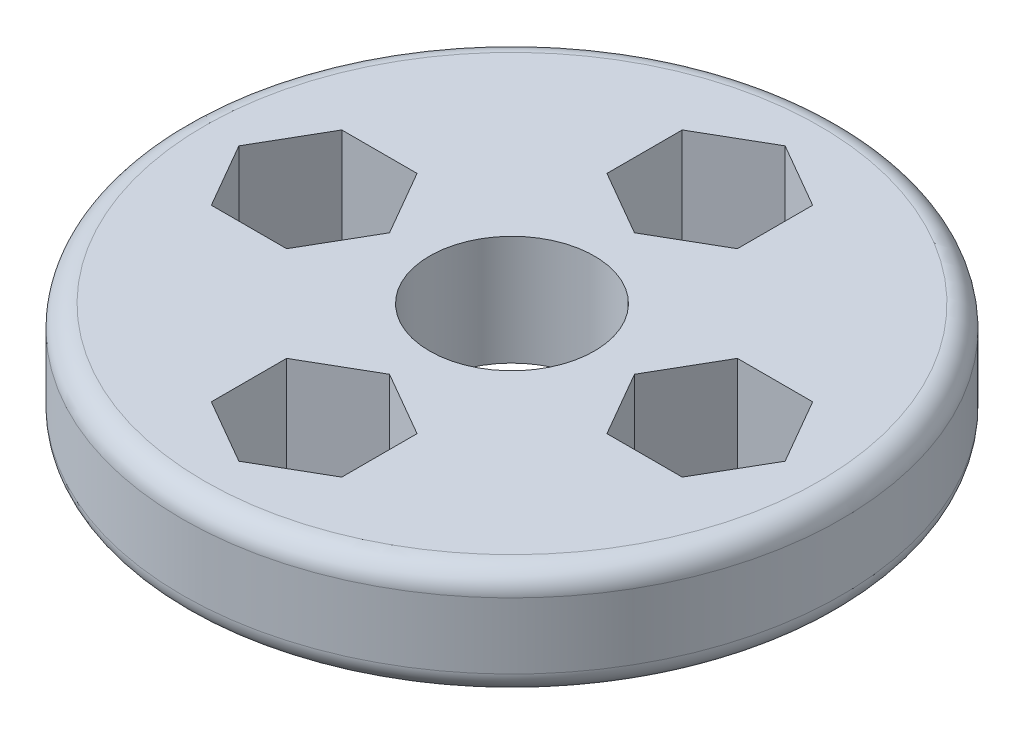
ISO-10303-21;
HEADER;
FILE_DESCRIPTION(('STEP AP214'),'2;1');
FILE_NAME('part.step','',(''),(''),'','','');
FILE_SCHEMA(('AUTOMOTIVE_DESIGN { 1 0 10303 214 1 1 1 1 }'));
ENDSEC;
DATA;
#1=APPLICATION_CONTEXT('core data for automotive mechanical design processes');
#2=APPLICATION_PROTOCOL_DEFINITION('international standard','automotive_design',2000,#1);
#3=PRODUCT_CONTEXT('',#1,'mechanical');
#4=PRODUCT('Part','Part','',(#3));
#5=PRODUCT_RELATED_PRODUCT_CATEGORY('part','',(#4));
#6=PRODUCT_DEFINITION_FORMATION('','',#4);
#7=PRODUCT_DEFINITION_CONTEXT('part definition',#1,'design');
#8=PRODUCT_DEFINITION('design','',#6,#7);
#9=PRODUCT_DEFINITION_SHAPE('','',#8);
#10=(LENGTH_UNIT() NAMED_UNIT(*) SI_UNIT(.MILLI.,.METRE.));
#11=(NAMED_UNIT(*) PLANE_ANGLE_UNIT() SI_UNIT($,.RADIAN.));
#12=(NAMED_UNIT(*) SI_UNIT($,.STERADIAN.) SOLID_ANGLE_UNIT());
#13=UNCERTAINTY_MEASURE_WITH_UNIT(LENGTH_MEASURE(1.E-05),#10,'distance_accuracy_value','');
#14=(GEOMETRIC_REPRESENTATION_CONTEXT(3) GLOBAL_UNCERTAINTY_ASSIGNED_CONTEXT((#13)) GLOBAL_UNIT_ASSIGNED_CONTEXT((#10,
#11,#12)) REPRESENTATION_CONTEXT('',''));
#15=CARTESIAN_POINT('',(0.,0.,0.));
#16=DIRECTION('',(0.,0.,1.));
#17=DIRECTION('',(1.,0.,0.));
#18=AXIS2_PLACEMENT_3D('',#15,#16,#17);
#19=CARTESIAN_POINT('',(0.,10.,0.));
#20=DIRECTION('',(0.,-1.,0.));
#21=DIRECTION('',(0.,0.,-1.));
#22=AXIS2_PLACEMENT_3D('',#19,#20,#21);
#23=CYLINDRICAL_SURFACE('',#22,30.);
#24=CARTESIAN_POINT('',(0.,2.,0.));
#25=DIRECTION('',(0.,1.,0.));
#26=DIRECTION('',(0.,0.,1.));
#27=AXIS2_PLACEMENT_3D('',#24,#25,#26);
#28=CIRCLE('',#27,30.);
#29=CARTESIAN_POINT('',(0.,2.,30.));
#30=VERTEX_POINT('',#29);
#31=EDGE_CURVE('E402',#30,#30,#28,.T.);
#32=ORIENTED_EDGE('',*,*,#31,.T.);
#33=EDGE_LOOP('',(#32));
#34=FACE_BOUND('',#33,.T.);
#35=CARTESIAN_POINT('',(0.,8.,0.));
#36=DIRECTION('',(0.,1.,0.));
#37=DIRECTION('',(0.,0.,1.));
#38=AXIS2_PLACEMENT_3D('',#35,#36,#37);
#39=CIRCLE('',#38,30.);
#40=CARTESIAN_POINT('',(0.,8.,30.));
#41=VERTEX_POINT('',#40);
#42=EDGE_CURVE('E397',#41,#41,#39,.F.);
#43=ORIENTED_EDGE('',*,*,#42,.T.);
#44=EDGE_LOOP('',(#43));
#45=FACE_BOUND('',#44,.T.);
#46=ADVANCED_FACE('F35',(#34,#45),#23,.T.);
#47=CARTESIAN_POINT('',(0.,10.,0.));
#48=DIRECTION('',(0.,1.,0.));
#49=DIRECTION('',(0.,0.,1.));
#50=AXIS2_PLACEMENT_3D('',#47,#48,#49);
#51=PLANE('',#50);
#52=DIRECTION('',(0.499999999999992,0.,-0.866025403784443));
#53=VECTOR('',#52,1.);
#54=CARTESIAN_POINT('',(-14.5786360829087,10.,5.93647889551821));
#55=LINE('',#54,#53);
#56=CARTESIAN_POINT('',(-14.5786360829087,10.,5.93647889551821));
#57=VERTEX_POINT('',#56);
#58=CARTESIAN_POINT('',(-11.1512083945428,10.,0.));
#59=VERTEX_POINT('',#58);
#60=EDGE_CURVE('E50',#57,#59,#55,.T.);
#61=ORIENTED_EDGE('',*,*,#60,.F.);
#62=DIRECTION('',(1.,0.,0.));
#63=VECTOR('',#62,1.);
#64=CARTESIAN_POINT('',(-21.4334914596406,10.,5.93647889551831));
#65=LINE('',#64,#63);
#66=CARTESIAN_POINT('',(-21.4334914596406,10.,5.93647889551831));
#67=VERTEX_POINT('',#66);
#68=EDGE_CURVE('E218',#67,#57,#65,.T.);
#69=ORIENTED_EDGE('',*,*,#68,.F.);
#70=DIRECTION('',(0.50000000000001,0.,0.866025403784433));
#71=VECTOR('',#70,1.);
#72=CARTESIAN_POINT('',(-24.8609191480067,10.,1.34668634528409E-13));
#73=LINE('',#72,#71);
#74=CARTESIAN_POINT('',(-24.8609191480067,10.,1.34668634528409E-13));
#75=VERTEX_POINT('',#74);
#76=EDGE_CURVE('E221',#75,#67,#73,.T.);
#77=ORIENTED_EDGE('',*,*,#76,.F.);
#78=DIRECTION('',(-0.499999999999992,0.,0.866025403784443));
#79=VECTOR('',#78,1.);
#80=CARTESIAN_POINT('',(-21.4334914596408,10.,-5.93647889551811));
#81=LINE('',#80,#79);
#82=CARTESIAN_POINT('',(-21.4334914596408,10.,-5.93647889551811));
#83=VERTEX_POINT('',#82);
#84=EDGE_CURVE('E238',#83,#75,#81,.T.);
#85=ORIENTED_EDGE('',*,*,#84,.F.);
#86=DIRECTION('',(-1.,0.,0.));
#87=VECTOR('',#86,1.);
#88=CARTESIAN_POINT('',(-14.5786360829088,10.,-5.93647889551816));
#89=LINE('',#88,#87);
#90=CARTESIAN_POINT('',(-14.5786360829088,10.,-5.93647889551816));
#91=VERTEX_POINT('',#90);
#92=EDGE_CURVE('E235',#91,#83,#89,.T.);
#93=ORIENTED_EDGE('',*,*,#92,.F.);
#94=DIRECTION('',(-0.500000000000004,0.,-0.866025403784436));
#95=VECTOR('',#94,1.);
#96=CARTESIAN_POINT('',(-11.1512083945428,10.,0.));
#97=LINE('',#96,#95);
#98=EDGE_CURVE('E232',#59,#91,#97,.T.);
#99=ORIENTED_EDGE('',*,*,#98,.F.);
#100=EDGE_LOOP('',(#61,#69,#77,#85,#93,#99));
#101=FACE_BOUND('',#100,.T.);
#102=DIRECTION('',(-0.866025403784442,0.,-0.499999999999995));
#103=VECTOR('',#102,1.);
#104=CARTESIAN_POINT('',(5.93647889551816,10.,14.5786360829087));
#105=LINE('',#104,#103);
#106=CARTESIAN_POINT('',(5.93647889551816,10.,14.5786360829087));
#107=VERTEX_POINT('',#106);
#108=CARTESIAN_POINT('',(0.,10.,11.1512083945428));
#109=VERTEX_POINT('',#108);
#110=EDGE_CURVE('E58',#107,#109,#105,.T.);
#111=ORIENTED_EDGE('',*,*,#110,.F.);
#112=DIRECTION('',(0.,0.,-1.));
#113=VECTOR('',#112,1.);
#114=CARTESIAN_POINT('',(5.93647889551823,10.,21.4334914596407));
#115=LINE('',#114,#113);
#116=CARTESIAN_POINT('',(5.93647889551823,10.,21.4334914596407));
#117=VERTEX_POINT('',#116);
#118=EDGE_CURVE('E257',#117,#107,#115,.T.);
#119=ORIENTED_EDGE('',*,*,#118,.F.);
#120=DIRECTION('',(0.866025403784435,0.,-0.500000000000007));
#121=VECTOR('',#120,1.);
#122=CARTESIAN_POINT('',(0.,10.,24.8609191480067));
#123=LINE('',#122,#121);
#124=CARTESIAN_POINT('',(0.,10.,24.8609191480067));
#125=VERTEX_POINT('',#124);
#126=EDGE_CURVE('E284',#125,#117,#123,.T.);
#127=ORIENTED_EDGE('',*,*,#126,.F.);
#128=DIRECTION('',(0.866025403784441,0.,0.499999999999995));
#129=VECTOR('',#128,1.);
#130=CARTESIAN_POINT('',(-5.93647889551818,10.,21.4334914596407));
#131=LINE('',#130,#129);
#132=CARTESIAN_POINT('',(-5.93647889551818,10.,21.4334914596407));
#133=VERTEX_POINT('',#132);
#134=EDGE_CURVE('E281',#133,#125,#131,.T.);
#135=ORIENTED_EDGE('',*,*,#134,.F.);
#136=DIRECTION('',(0.,0.,1.));
#137=VECTOR('',#136,1.);
#138=CARTESIAN_POINT('',(-5.93647889551821,10.,14.5786360829088));
#139=LINE('',#138,#137);
#140=CARTESIAN_POINT('',(-5.93647889551821,10.,14.5786360829088));
#141=VERTEX_POINT('',#140);
#142=EDGE_CURVE('E278',#141,#133,#139,.T.);
#143=ORIENTED_EDGE('',*,*,#142,.F.);
#144=DIRECTION('',(-0.866025403784438,0.,0.500000000000001));
#145=VECTOR('',#144,1.);
#146=CARTESIAN_POINT('',(0.,10.,11.1512083945428));
#147=LINE('',#146,#145);
#148=EDGE_CURVE('E274',#109,#141,#147,.T.);
#149=ORIENTED_EDGE('',*,*,#148,.F.);
#150=EDGE_LOOP('',(#111,#119,#127,#135,#143,#149));
#151=FACE_BOUND('',#150,.T.);
#152=DIRECTION('',(-0.499999999999986,0.,0.866025403784447));
#153=VECTOR('',#152,1.);
#154=CARTESIAN_POINT('',(14.5786360829087,10.,-5.93647889551831));
#155=LINE('',#154,#153);
#156=CARTESIAN_POINT('',(14.5786360829087,10.,-5.93647889551831));
#157=VERTEX_POINT('',#156);
#158=CARTESIAN_POINT('',(11.1512083945428,10.,-1.16226472890446E-13));
#159=VERTEX_POINT('',#158);
#160=EDGE_CURVE('E319',#157,#159,#155,.T.);
#161=ORIENTED_EDGE('',*,*,#160,.F.);
#162=DIRECTION('',(-1.,0.,0.));
#163=VECTOR('',#162,1.);
#164=CARTESIAN_POINT('',(21.4334914596406,10.,-5.93647889551846));
#165=LINE('',#164,#163);
#166=CARTESIAN_POINT('',(21.4334914596406,10.,-5.93647889551846));
#167=VERTEX_POINT('',#166);
#168=EDGE_CURVE('E303',#167,#157,#165,.T.);
#169=ORIENTED_EDGE('',*,*,#168,.F.);
#170=DIRECTION('',(-0.500000000000016,0.,-0.866025403784429));
#171=VECTOR('',#170,1.);
#172=CARTESIAN_POINT('',(24.8609191480067,10.,-3.08271505071916E-13));
#173=LINE('',#172,#171);
#174=CARTESIAN_POINT('',(24.8609191480067,10.,-3.08271505071916E-13));
#175=VERTEX_POINT('',#174);
#176=EDGE_CURVE('E330',#175,#167,#173,.T.);
#177=ORIENTED_EDGE('',*,*,#176,.F.);
#178=DIRECTION('',(0.499999999999986,0.,-0.866025403784447));
#179=VECTOR('',#178,1.);
#180=CARTESIAN_POINT('',(21.4334914596408,10.,5.93647889551796));
#181=LINE('',#180,#179);
#182=CARTESIAN_POINT('',(21.4334914596408,10.,5.93647889551796));
#183=VERTEX_POINT('',#182);
#184=EDGE_CURVE('E327',#183,#175,#181,.T.);
#185=ORIENTED_EDGE('',*,*,#184,.F.);
#186=DIRECTION('',(1.,0.,0.));
#187=VECTOR('',#186,1.);
#188=CARTESIAN_POINT('',(14.5786360829089,10.,5.93647889551806));
#189=LINE('',#188,#187);
#190=CARTESIAN_POINT('',(14.5786360829089,10.,5.93647889551806));
#191=VERTEX_POINT('',#190);
#192=EDGE_CURVE('E324',#191,#183,#189,.T.);
#193=ORIENTED_EDGE('',*,*,#192,.F.);
#194=DIRECTION('',(0.50000000000001,0.,0.866025403784433));
#195=VECTOR('',#194,1.);
#196=CARTESIAN_POINT('',(11.1512083945428,10.,-1.16802708045291E-13));
#197=LINE('',#196,#195);
#198=EDGE_CURVE('E321',#159,#191,#197,.T.);
#199=ORIENTED_EDGE('',*,*,#198,.F.);
#200=EDGE_LOOP('',(#161,#169,#177,#185,#193,#199));
#201=FACE_BOUND('',#200,.T.);
#202=DIRECTION('',(0.866025403784442,0.,0.499999999999995));
#203=VECTOR('',#202,1.);
#204=CARTESIAN_POINT('',(-5.93647889551816,10.,-14.5786360829087));
#205=LINE('',#204,#203);
#206=CARTESIAN_POINT('',(-5.93647889551816,10.,-14.5786360829087));
#207=VERTEX_POINT('',#206);
#208=CARTESIAN_POINT('',(0.,10.,-11.1512083945428));
#209=VERTEX_POINT('',#208);
#210=EDGE_CURVE('E245',#207,#209,#205,.T.);
#211=ORIENTED_EDGE('',*,*,#210,.F.);
#212=DIRECTION('',(0.,0.,1.));
#213=VECTOR('',#212,1.);
#214=CARTESIAN_POINT('',(-5.93647889551823,10.,-21.4334914596407));
#215=LINE('',#214,#213);
#216=CARTESIAN_POINT('',(-5.93647889551823,10.,-21.4334914596407));
#217=VERTEX_POINT('',#216);
#218=EDGE_CURVE('E350',#217,#207,#215,.T.);
#219=ORIENTED_EDGE('',*,*,#218,.F.);
#220=DIRECTION('',(-0.866025403784435,0.,0.500000000000007));
#221=VECTOR('',#220,1.);
#222=CARTESIAN_POINT('',(0.,10.,-24.8609191480067));
#223=LINE('',#222,#221);
#224=CARTESIAN_POINT('',(0.,10.,-24.8609191480067));
#225=VERTEX_POINT('',#224);
#226=EDGE_CURVE('E376',#225,#217,#223,.T.);
#227=ORIENTED_EDGE('',*,*,#226,.F.);
#228=DIRECTION('',(-0.866025403784441,0.,-0.499999999999995));
#229=VECTOR('',#228,1.);
#230=CARTESIAN_POINT('',(5.93647889551818,10.,-21.4334914596407));
#231=LINE('',#230,#229);
#232=CARTESIAN_POINT('',(5.93647889551818,10.,-21.4334914596407));
#233=VERTEX_POINT('',#232);
#234=EDGE_CURVE('E373',#233,#225,#231,.T.);
#235=ORIENTED_EDGE('',*,*,#234,.F.);
#236=DIRECTION('',(0.,0.,-1.));
#237=VECTOR('',#236,1.);
#238=CARTESIAN_POINT('',(5.93647889551821,10.,-14.5786360829088));
#239=LINE('',#238,#237);
#240=CARTESIAN_POINT('',(5.93647889551821,10.,-14.5786360829088));
#241=VERTEX_POINT('',#240);
#242=EDGE_CURVE('E370',#241,#233,#239,.T.);
#243=ORIENTED_EDGE('',*,*,#242,.F.);
#244=DIRECTION('',(0.866025403784438,0.,-0.500000000000001));
#245=VECTOR('',#244,1.);
#246=CARTESIAN_POINT('',(0.,10.,-11.1512083945428));
#247=LINE('',#246,#245);
#248=EDGE_CURVE('E367',#209,#241,#247,.T.);
#249=ORIENTED_EDGE('',*,*,#248,.F.);
#250=EDGE_LOOP('',(#211,#219,#227,#235,#243,#249));
#251=FACE_BOUND('',#250,.T.);
#252=CARTESIAN_POINT('',(0.,10.,0.));
#253=DIRECTION('',(0.,1.,0.));
#254=DIRECTION('',(0.,0.,1.));
#255=AXIS2_PLACEMENT_3D('',#252,#253,#254);
#256=CIRCLE('',#255,28.);
#257=CARTESIAN_POINT('',(0.,10.,28.));
#258=VERTEX_POINT('',#257);
#259=EDGE_CURVE('E11',#258,#258,#256,.T.);
#260=ORIENTED_EDGE('',*,*,#259,.T.);
#261=EDGE_LOOP('',(#260));
#262=FACE_BOUND('',#261,.T.);
#263=CARTESIAN_POINT('',(0.,10.,0.));
#264=DIRECTION('',(0.,1.,0.));
#265=DIRECTION('',(0.,0.,1.));
#266=AXIS2_PLACEMENT_3D('',#263,#264,#265);
#267=CIRCLE('',#266,7.5);
#268=CARTESIAN_POINT('',(0.,10.,7.5));
#269=VERTEX_POINT('',#268);
#270=EDGE_CURVE('E383',#269,#269,#267,.T.);
#271=ORIENTED_EDGE('',*,*,#270,.F.);
#272=EDGE_LOOP('',(#271));
#273=FACE_BOUND('',#272,.T.);
#274=ADVANCED_FACE('F417',(#101,#151,#201,#251,#262,#273),#51,.T.);
#275=CARTESIAN_POINT('',(0.,0.,0.));
#276=DIRECTION('',(0.,1.,0.));
#277=DIRECTION('',(0.,0.,1.));
#278=AXIS2_PLACEMENT_3D('',#275,#276,#277);
#279=PLANE('',#278);
#280=DIRECTION('',(1.,0.,0.));
#281=VECTOR('',#280,1.);
#282=CARTESIAN_POINT('',(-21.4334914596406,0.,5.93647889551831));
#283=LINE('',#282,#281);
#284=CARTESIAN_POINT('',(-21.4334914596406,0.,5.93647889551831));
#285=VERTEX_POINT('',#284);
#286=CARTESIAN_POINT('',(-14.5786360829087,0.,5.93647889551821));
#287=VERTEX_POINT('',#286);
#288=EDGE_CURVE('E204',#285,#287,#283,.T.);
#289=ORIENTED_EDGE('',*,*,#288,.T.);
#290=DIRECTION('',(0.499999999999992,0.,-0.866025403784443));
#291=VECTOR('',#290,1.);
#292=CARTESIAN_POINT('',(-14.5786360829087,0.,5.93647889551821));
#293=LINE('',#292,#291);
#294=CARTESIAN_POINT('',(-11.1512083945428,0.,0.));
#295=VERTEX_POINT('',#294);
#296=EDGE_CURVE('E198',#287,#295,#293,.T.);
#297=ORIENTED_EDGE('',*,*,#296,.T.);
#298=DIRECTION('',(-0.500000000000004,0.,-0.866025403784436));
#299=VECTOR('',#298,1.);
#300=CARTESIAN_POINT('',(-11.1512083945428,0.,0.));
#301=LINE('',#300,#299);
#302=CARTESIAN_POINT('',(-14.5786360829088,0.,-5.93647889551816));
#303=VERTEX_POINT('',#302);
#304=EDGE_CURVE('E208',#295,#303,#301,.T.);
#305=ORIENTED_EDGE('',*,*,#304,.T.);
#306=DIRECTION('',(-1.,0.,0.));
#307=VECTOR('',#306,1.);
#308=CARTESIAN_POINT('',(-14.5786360829088,0.,-5.93647889551816));
#309=LINE('',#308,#307);
#310=CARTESIAN_POINT('',(-21.4334914596408,0.,-5.93647889551811));
#311=VERTEX_POINT('',#310);
#312=EDGE_CURVE('E212',#303,#311,#309,.T.);
#313=ORIENTED_EDGE('',*,*,#312,.T.);
#314=DIRECTION('',(-0.499999999999992,0.,0.866025403784443));
#315=VECTOR('',#314,1.);
#316=CARTESIAN_POINT('',(-21.4334914596408,0.,-5.93647889551811));
#317=LINE('',#316,#315);
#318=CARTESIAN_POINT('',(-24.8609191480067,0.,1.34668634528409E-13));
#319=VERTEX_POINT('',#318);
#320=EDGE_CURVE('E225',#311,#319,#317,.T.);
#321=ORIENTED_EDGE('',*,*,#320,.T.);
#322=DIRECTION('',(0.50000000000001,0.,0.866025403784433));
#323=VECTOR('',#322,1.);
#324=CARTESIAN_POINT('',(-24.8609191480067,0.,1.34668634528409E-13));
#325=LINE('',#324,#323);
#326=EDGE_CURVE('E228',#319,#285,#325,.T.);
#327=ORIENTED_EDGE('',*,*,#326,.T.);
#328=EDGE_LOOP('',(#289,#297,#305,#313,#321,#327));
#329=FACE_BOUND('',#328,.T.);
#330=DIRECTION('',(0.,0.,-1.));
#331=VECTOR('',#330,1.);
#332=CARTESIAN_POINT('',(5.93647889551823,0.,21.4334914596407));
#333=LINE('',#332,#331);
#334=CARTESIAN_POINT('',(5.93647889551823,0.,21.4334914596407));
#335=VERTEX_POINT('',#334);
#336=CARTESIAN_POINT('',(5.93647889551816,0.,14.5786360829087));
#337=VERTEX_POINT('',#336);
#338=EDGE_CURVE('E269',#335,#337,#333,.T.);
#339=ORIENTED_EDGE('',*,*,#338,.T.);
#340=DIRECTION('',(-0.866025403784442,0.,-0.499999999999995));
#341=VECTOR('',#340,1.);
#342=CARTESIAN_POINT('',(5.93647889551816,0.,14.5786360829087));
#343=LINE('',#342,#341);
#344=CARTESIAN_POINT('',(0.,0.,11.1512083945428));
#345=VERTEX_POINT('',#344);
#346=EDGE_CURVE('E253',#337,#345,#343,.T.);
#347=ORIENTED_EDGE('',*,*,#346,.T.);
#348=DIRECTION('',(-0.866025403784438,0.,0.500000000000001));
#349=VECTOR('',#348,1.);
#350=CARTESIAN_POINT('',(0.,0.,11.1512083945428));
#351=LINE('',#350,#349);
#352=CARTESIAN_POINT('',(-5.93647889551821,0.,14.5786360829088));
#353=VERTEX_POINT('',#352);
#354=EDGE_CURVE('E256',#345,#353,#351,.T.);
#355=ORIENTED_EDGE('',*,*,#354,.T.);
#356=DIRECTION('',(0.,0.,1.));
#357=VECTOR('',#356,1.);
#358=CARTESIAN_POINT('',(-5.93647889551821,0.,14.5786360829088));
#359=LINE('',#358,#357);
#360=CARTESIAN_POINT('',(-5.93647889551818,0.,21.4334914596407));
#361=VERTEX_POINT('',#360);
#362=EDGE_CURVE('E260',#353,#361,#359,.T.);
#363=ORIENTED_EDGE('',*,*,#362,.T.);
#364=DIRECTION('',(0.866025403784441,0.,0.499999999999995));
#365=VECTOR('',#364,1.);
#366=CARTESIAN_POINT('',(-5.93647889551818,0.,21.4334914596407));
#367=LINE('',#366,#365);
#368=CARTESIAN_POINT('',(0.,0.,24.8609191480067));
#369=VERTEX_POINT('',#368);
#370=EDGE_CURVE('E263',#361,#369,#367,.T.);
#371=ORIENTED_EDGE('',*,*,#370,.T.);
#372=DIRECTION('',(0.866025403784435,0.,-0.500000000000007));
#373=VECTOR('',#372,1.);
#374=CARTESIAN_POINT('',(0.,0.,24.8609191480067));
#375=LINE('',#374,#373);
#376=EDGE_CURVE('E266',#369,#335,#375,.T.);
#377=ORIENTED_EDGE('',*,*,#376,.T.);
#378=EDGE_LOOP('',(#339,#347,#355,#363,#371,#377));
#379=FACE_BOUND('',#378,.T.);
#380=DIRECTION('',(-1.,0.,0.));
#381=VECTOR('',#380,1.);
#382=CARTESIAN_POINT('',(21.4334914596406,0.,-5.93647889551846));
#383=LINE('',#382,#381);
#384=CARTESIAN_POINT('',(21.4334914596406,0.,-5.93647889551846));
#385=VERTEX_POINT('',#384);
#386=CARTESIAN_POINT('',(14.5786360829087,0.,-5.93647889551831));
#387=VERTEX_POINT('',#386);
#388=EDGE_CURVE('E315',#385,#387,#383,.T.);
#389=ORIENTED_EDGE('',*,*,#388,.T.);
#390=DIRECTION('',(-0.499999999999986,0.,0.866025403784447));
#391=VECTOR('',#390,1.);
#392=CARTESIAN_POINT('',(14.5786360829087,0.,-5.93647889551831));
#393=LINE('',#392,#391);
#394=CARTESIAN_POINT('',(11.1512083945428,0.,-1.16802708045291E-13));
#395=VERTEX_POINT('',#394);
#396=EDGE_CURVE('E299',#387,#395,#393,.T.);
#397=ORIENTED_EDGE('',*,*,#396,.T.);
#398=DIRECTION('',(0.50000000000001,0.,0.866025403784433));
#399=VECTOR('',#398,1.);
#400=CARTESIAN_POINT('',(11.1512083945428,0.,-1.16802708045291E-13));
#401=LINE('',#400,#399);
#402=CARTESIAN_POINT('',(14.5786360829089,0.,5.93647889551806));
#403=VERTEX_POINT('',#402);
#404=EDGE_CURVE('E302',#395,#403,#401,.T.);
#405=ORIENTED_EDGE('',*,*,#404,.T.);
#406=DIRECTION('',(1.,0.,0.));
#407=VECTOR('',#406,1.);
#408=CARTESIAN_POINT('',(14.5786360829089,0.,5.93647889551806));
#409=LINE('',#408,#407);
#410=CARTESIAN_POINT('',(21.4334914596408,0.,5.93647889551796));
#411=VERTEX_POINT('',#410);
#412=EDGE_CURVE('E306',#403,#411,#409,.T.);
#413=ORIENTED_EDGE('',*,*,#412,.T.);
#414=DIRECTION('',(0.499999999999986,0.,-0.866025403784447));
#415=VECTOR('',#414,1.);
#416=CARTESIAN_POINT('',(21.4334914596408,0.,5.93647889551796));
#417=LINE('',#416,#415);
#418=CARTESIAN_POINT('',(24.8609191480067,0.,-3.08271505071916E-13));
#419=VERTEX_POINT('',#418);
#420=EDGE_CURVE('E309',#411,#419,#417,.T.);
#421=ORIENTED_EDGE('',*,*,#420,.T.);
#422=DIRECTION('',(-0.500000000000016,0.,-0.866025403784429));
#423=VECTOR('',#422,1.);
#424=CARTESIAN_POINT('',(24.8609191480067,0.,-3.08271505071916E-13));
#425=LINE('',#424,#423);
#426=EDGE_CURVE('E312',#419,#385,#425,.T.);
#427=ORIENTED_EDGE('',*,*,#426,.T.);
#428=EDGE_LOOP('',(#389,#397,#405,#413,#421,#427));
#429=FACE_BOUND('',#428,.T.);
#430=DIRECTION('',(0.,0.,1.));
#431=VECTOR('',#430,1.);
#432=CARTESIAN_POINT('',(-5.93647889551823,0.,-21.4334914596407));
#433=LINE('',#432,#431);
#434=CARTESIAN_POINT('',(-5.93647889551823,0.,-21.4334914596407));
#435=VERTEX_POINT('',#434);
#436=CARTESIAN_POINT('',(-5.93647889551816,0.,-14.5786360829087));
#437=VERTEX_POINT('',#436);
#438=EDGE_CURVE('E362',#435,#437,#433,.T.);
#439=ORIENTED_EDGE('',*,*,#438,.T.);
#440=DIRECTION('',(0.866025403784442,0.,0.499999999999995));
#441=VECTOR('',#440,1.);
#442=CARTESIAN_POINT('',(-5.93647889551816,0.,-14.5786360829087));
#443=LINE('',#442,#441);
#444=CARTESIAN_POINT('',(0.,0.,-11.1512083945428));
#445=VERTEX_POINT('',#444);
#446=EDGE_CURVE('E346',#437,#445,#443,.T.);
#447=ORIENTED_EDGE('',*,*,#446,.T.);
#448=DIRECTION('',(0.866025403784438,0.,-0.500000000000001));
#449=VECTOR('',#448,1.);
#450=CARTESIAN_POINT('',(0.,0.,-11.1512083945428));
#451=LINE('',#450,#449);
#452=CARTESIAN_POINT('',(5.93647889551821,0.,-14.5786360829088));
#453=VERTEX_POINT('',#452);
#454=EDGE_CURVE('E349',#445,#453,#451,.T.);
#455=ORIENTED_EDGE('',*,*,#454,.T.);
#456=DIRECTION('',(0.,0.,-1.));
#457=VECTOR('',#456,1.);
#458=CARTESIAN_POINT('',(5.93647889551821,0.,-14.5786360829088));
#459=LINE('',#458,#457);
#460=CARTESIAN_POINT('',(5.93647889551818,0.,-21.4334914596407));
#461=VERTEX_POINT('',#460);
#462=EDGE_CURVE('E353',#453,#461,#459,.T.);
#463=ORIENTED_EDGE('',*,*,#462,.T.);
#464=DIRECTION('',(-0.866025403784441,0.,-0.499999999999995));
#465=VECTOR('',#464,1.);
#466=CARTESIAN_POINT('',(5.93647889551818,0.,-21.4334914596407));
#467=LINE('',#466,#465);
#468=CARTESIAN_POINT('',(0.,0.,-24.8609191480067));
#469=VERTEX_POINT('',#468);
#470=EDGE_CURVE('E356',#461,#469,#467,.T.);
#471=ORIENTED_EDGE('',*,*,#470,.T.);
#472=DIRECTION('',(-0.866025403784435,0.,0.500000000000007));
#473=VECTOR('',#472,1.);
#474=CARTESIAN_POINT('',(0.,0.,-24.8609191480067));
#475=LINE('',#474,#473);
#476=EDGE_CURVE('E359',#469,#435,#475,.T.);
#477=ORIENTED_EDGE('',*,*,#476,.T.);
#478=EDGE_LOOP('',(#439,#447,#455,#463,#471,#477));
#479=FACE_BOUND('',#478,.T.);
#480=CARTESIAN_POINT('',(0.,0.,0.));
#481=DIRECTION('',(0.,1.,0.));
#482=DIRECTION('',(0.,0.,1.));
#483=AXIS2_PLACEMENT_3D('',#480,#481,#482);
#484=CIRCLE('',#483,28.);
#485=CARTESIAN_POINT('',(0.,0.,28.));
#486=VERTEX_POINT('',#485);
#487=EDGE_CURVE('E43',#486,#486,#484,.F.);
#488=ORIENTED_EDGE('',*,*,#487,.T.);
#489=EDGE_LOOP('',(#488));
#490=FACE_BOUND('',#489,.T.);
#491=CARTESIAN_POINT('',(0.,0.,0.));
#492=DIRECTION('',(0.,1.,0.));
#493=DIRECTION('',(0.,0.,1.));
#494=AXIS2_PLACEMENT_3D('',#491,#492,#493);
#495=CIRCLE('',#494,7.5);
#496=CARTESIAN_POINT('',(0.,0.,7.5));
#497=VERTEX_POINT('',#496);
#498=EDGE_CURVE('E394',#497,#497,#495,.T.);
#499=ORIENTED_EDGE('',*,*,#498,.T.);
#500=EDGE_LOOP('',(#499));
#501=FACE_BOUND('',#500,.T.);
#502=ADVANCED_FACE('F214',(#329,#379,#429,#479,#490,#501),#279,.F.);
#503=CARTESIAN_POINT('',(0.,0.,0.));
#504=DIRECTION('',(0.,1.,0.));
#505=DIRECTION('',(0.,0.,1.));
#506=AXIS2_PLACEMENT_3D('',#503,#504,#505);
#507=CYLINDRICAL_SURFACE('',#506,7.5);
#508=ORIENTED_EDGE('',*,*,#498,.F.);
#509=EDGE_LOOP('',(#508));
#510=FACE_BOUND('',#509,.T.);
#511=ORIENTED_EDGE('',*,*,#270,.T.);
#512=EDGE_LOOP('',(#511));
#513=FACE_BOUND('',#512,.T.);
#514=ADVANCED_FACE('F412',(#510,#513),#507,.F.);
#515=CARTESIAN_POINT('',(0.,2.,0.));
#516=DIRECTION('',(0.,1.,0.));
#517=DIRECTION('',(0.,0.,1.));
#518=AXIS2_PLACEMENT_3D('',#515,#516,#517);
#519=TOROIDAL_SURFACE('',#518,28.,2.);
#520=ORIENTED_EDGE('',*,*,#487,.F.);
#521=EDGE_LOOP('',(#520));
#522=FACE_BOUND('',#521,.T.);
#523=ORIENTED_EDGE('',*,*,#31,.F.);
#524=EDGE_LOOP('',(#523));
#525=FACE_BOUND('',#524,.T.);
#526=ADVANCED_FACE('F409',(#522,#525),#519,.T.);
#527=CARTESIAN_POINT('',(0.,8.,0.));
#528=DIRECTION('',(0.,1.,0.));
#529=DIRECTION('',(0.,0.,1.));
#530=AXIS2_PLACEMENT_3D('',#527,#528,#529);
#531=TOROIDAL_SURFACE('',#530,28.,2.);
#532=ORIENTED_EDGE('',*,*,#42,.F.);
#533=EDGE_LOOP('',(#532));
#534=FACE_BOUND('',#533,.T.);
#535=ORIENTED_EDGE('',*,*,#259,.F.);
#536=EDGE_LOOP('',(#535));
#537=FACE_BOUND('',#536,.T.);
#538=ADVANCED_FACE('F37',(#534,#537),#531,.T.);
#539=CARTESIAN_POINT('',(-5.93647889551816,0.,-14.5786360829087));
#540=DIRECTION('',(-0.499999999999995,0.,0.866025403784442));
#541=DIRECTION('',(0.866025403784442,0.,0.499999999999995));
#542=AXIS2_PLACEMENT_3D('',#539,#540,#541);
#543=PLANE('',#542);
#544=ORIENTED_EDGE('',*,*,#210,.T.);
#545=DIRECTION('',(0.,1.,0.));
#546=VECTOR('',#545,1.);
#547=CARTESIAN_POINT('',(0.,0.,-11.1512083945428));
#548=LINE('',#547,#546);
#549=EDGE_CURVE('E365',#445,#209,#548,.T.);
#550=ORIENTED_EDGE('',*,*,#549,.F.);
#551=ORIENTED_EDGE('',*,*,#446,.F.);
#552=DIRECTION('',(0.,1.,0.));
#553=VECTOR('',#552,1.);
#554=CARTESIAN_POINT('',(-5.93647889551816,0.,-14.5786360829087));
#555=LINE('',#554,#553);
#556=EDGE_CURVE('E381',#437,#207,#555,.T.);
#557=ORIENTED_EDGE('',*,*,#556,.T.);
#558=EDGE_LOOP('',(#544,#550,#551,#557));
#559=FACE_BOUND('',#558,.T.);
#560=ADVANCED_FACE('F423',(#559),#543,.F.);
#561=CARTESIAN_POINT('',(-5.93647889551823,0.,-21.4334914596407));
#562=DIRECTION('',(-1.,0.,0.));
#563=DIRECTION('',(0.,0.,1.));
#564=AXIS2_PLACEMENT_3D('',#561,#562,#563);
#565=PLANE('',#564);
#566=ORIENTED_EDGE('',*,*,#218,.T.);
#567=ORIENTED_EDGE('',*,*,#556,.F.);
#568=ORIENTED_EDGE('',*,*,#438,.F.);
#569=DIRECTION('',(0.,1.,0.));
#570=VECTOR('',#569,1.);
#571=CARTESIAN_POINT('',(-5.93647889551823,0.,-21.4334914596407));
#572=LINE('',#571,#570);
#573=EDGE_CURVE('E384',#435,#217,#572,.T.);
#574=ORIENTED_EDGE('',*,*,#573,.T.);
#575=EDGE_LOOP('',(#566,#567,#568,#574));
#576=FACE_BOUND('',#575,.T.);
#577=ADVANCED_FACE('F443',(#576),#565,.F.);
#578=CARTESIAN_POINT('',(0.,0.,-24.8609191480067));
#579=DIRECTION('',(-0.500000000000007,0.,-0.866025403784434));
#580=DIRECTION('',(-0.866025403784435,0.,0.500000000000007));
#581=AXIS2_PLACEMENT_3D('',#578,#579,#580);
#582=PLANE('',#581);
#583=ORIENTED_EDGE('',*,*,#226,.T.);
#584=ORIENTED_EDGE('',*,*,#573,.F.);
#585=ORIENTED_EDGE('',*,*,#476,.F.);
#586=DIRECTION('',(0.,1.,0.));
#587=VECTOR('',#586,1.);
#588=CARTESIAN_POINT('',(0.,0.,-24.8609191480067));
#589=LINE('',#588,#587);
#590=EDGE_CURVE('E386',#469,#225,#589,.T.);
#591=ORIENTED_EDGE('',*,*,#590,.T.);
#592=EDGE_LOOP('',(#583,#584,#585,#591));
#593=FACE_BOUND('',#592,.T.);
#594=ADVANCED_FACE('F457',(#593),#582,.F.);
#595=CARTESIAN_POINT('',(5.93647889551818,0.,-21.4334914596407));
#596=DIRECTION('',(0.499999999999995,0.,-0.866025403784442));
#597=DIRECTION('',(-0.866025403784442,0.,-0.499999999999995));
#598=AXIS2_PLACEMENT_3D('',#595,#596,#597);
#599=PLANE('',#598);
#600=ORIENTED_EDGE('',*,*,#234,.T.);
#601=ORIENTED_EDGE('',*,*,#590,.F.);
#602=ORIENTED_EDGE('',*,*,#470,.F.);
#603=DIRECTION('',(0.,1.,0.));
#604=VECTOR('',#603,1.);
#605=CARTESIAN_POINT('',(5.93647889551818,0.,-21.4334914596407));
#606=LINE('',#605,#604);
#607=EDGE_CURVE('E388',#461,#233,#606,.T.);
#608=ORIENTED_EDGE('',*,*,#607,.T.);
#609=EDGE_LOOP('',(#600,#601,#602,#608));
#610=FACE_BOUND('',#609,.T.);
#611=ADVANCED_FACE('F453',(#610),#599,.F.);
#612=CARTESIAN_POINT('',(5.93647889551821,0.,-14.5786360829088));
#613=DIRECTION('',(1.,0.,0.));
#614=DIRECTION('',(0.,0.,-1.));
#615=AXIS2_PLACEMENT_3D('',#612,#613,#614);
#616=PLANE('',#615);
#617=ORIENTED_EDGE('',*,*,#242,.T.);
#618=ORIENTED_EDGE('',*,*,#607,.F.);
#619=ORIENTED_EDGE('',*,*,#462,.F.);
#620=DIRECTION('',(0.,1.,0.));
#621=VECTOR('',#620,1.);
#622=CARTESIAN_POINT('',(5.93647889551821,0.,-14.5786360829088));
#623=LINE('',#622,#621);
#624=EDGE_CURVE('E390',#453,#241,#623,.T.);
#625=ORIENTED_EDGE('',*,*,#624,.T.);
#626=EDGE_LOOP('',(#617,#618,#619,#625));
#627=FACE_BOUND('',#626,.T.);
#628=ADVANCED_FACE('F449',(#627),#616,.F.);
#629=CARTESIAN_POINT('',(0.,0.,-11.1512083945428));
#630=DIRECTION('',(0.500000000000001,0.,0.866025403784438));
#631=DIRECTION('',(0.866025403784438,0.,-0.500000000000001));
#632=AXIS2_PLACEMENT_3D('',#629,#630,#631);
#633=PLANE('',#632);
#634=ORIENTED_EDGE('',*,*,#248,.T.);
#635=ORIENTED_EDGE('',*,*,#624,.F.);
#636=ORIENTED_EDGE('',*,*,#454,.F.);
#637=ORIENTED_EDGE('',*,*,#549,.T.);
#638=EDGE_LOOP('',(#634,#635,#636,#637));
#639=FACE_BOUND('',#638,.T.);
#640=ADVANCED_FACE('F445',(#639),#633,.F.);
#641=CARTESIAN_POINT('',(14.5786360829087,0.,-5.93647889551831));
#642=DIRECTION('',(-0.866025403784447,0.,-0.499999999999986));
#643=DIRECTION('',(-0.499999999999986,0.,0.866025403784447));
#644=AXIS2_PLACEMENT_3D('',#641,#642,#643);
#645=PLANE('',#644);
#646=ORIENTED_EDGE('',*,*,#160,.T.);
#647=DIRECTION('',(0.,1.,0.));
#648=VECTOR('',#647,1.);
#649=CARTESIAN_POINT('',(11.1512083945428,0.,-1.16802708045291E-13));
#650=LINE('',#649,#648);
#651=EDGE_CURVE('E318',#395,#159,#650,.T.);
#652=ORIENTED_EDGE('',*,*,#651,.F.);
#653=ORIENTED_EDGE('',*,*,#396,.F.);
#654=DIRECTION('',(0.,1.,0.));
#655=VECTOR('',#654,1.);
#656=CARTESIAN_POINT('',(14.5786360829087,0.,-5.93647889551831));
#657=LINE('',#656,#655);
#658=EDGE_CURVE('E275',#387,#157,#657,.T.);
#659=ORIENTED_EDGE('',*,*,#658,.T.);
#660=EDGE_LOOP('',(#646,#652,#653,#659));
#661=FACE_BOUND('',#660,.T.);
#662=ADVANCED_FACE('F448',(#661),#645,.F.);
#663=CARTESIAN_POINT('',(21.4334914596406,0.,-5.93647889551846));
#664=DIRECTION('',(0.,0.,-1.));
#665=DIRECTION('',(-1.,0.,0.));
#666=AXIS2_PLACEMENT_3D('',#663,#664,#665);
#667=PLANE('',#666);
#668=ORIENTED_EDGE('',*,*,#168,.T.);
#669=ORIENTED_EDGE('',*,*,#658,.F.);
#670=ORIENTED_EDGE('',*,*,#388,.F.);
#671=DIRECTION('',(0.,1.,0.));
#672=VECTOR('',#671,1.);
#673=CARTESIAN_POINT('',(21.4334914596406,0.,-5.93647889551846));
#674=LINE('',#673,#672);
#675=EDGE_CURVE('E336',#385,#167,#674,.T.);
#676=ORIENTED_EDGE('',*,*,#675,.T.);
#677=EDGE_LOOP('',(#668,#669,#670,#676));
#678=FACE_BOUND('',#677,.T.);
#679=ADVANCED_FACE('F467',(#678),#667,.F.);
#680=CARTESIAN_POINT('',(24.8609191480067,0.,-3.08271505071916E-13));
#681=DIRECTION('',(0.866025403784429,0.,-0.500000000000016));
#682=DIRECTION('',(-0.500000000000016,0.,-0.866025403784429));
#683=AXIS2_PLACEMENT_3D('',#680,#681,#682);
#684=PLANE('',#683);
#685=ORIENTED_EDGE('',*,*,#176,.T.);
#686=ORIENTED_EDGE('',*,*,#675,.F.);
#687=ORIENTED_EDGE('',*,*,#426,.F.);
#688=DIRECTION('',(0.,1.,0.));
#689=VECTOR('',#688,1.);
#690=CARTESIAN_POINT('',(24.8609191480067,0.,-3.08271505071916E-13));
#691=LINE('',#690,#689);
#692=EDGE_CURVE('E338',#419,#175,#691,.T.);
#693=ORIENTED_EDGE('',*,*,#692,.T.);
#694=EDGE_LOOP('',(#685,#686,#687,#693));
#695=FACE_BOUND('',#694,.T.);
#696=ADVANCED_FACE('F481',(#695),#684,.F.);
#697=CARTESIAN_POINT('',(21.4334914596408,0.,5.93647889551796));
#698=DIRECTION('',(0.866025403784447,0.,0.499999999999986));
#699=DIRECTION('',(0.499999999999986,0.,-0.866025403784447));
#700=AXIS2_PLACEMENT_3D('',#697,#698,#699);
#701=PLANE('',#700);
#702=ORIENTED_EDGE('',*,*,#184,.T.);
#703=ORIENTED_EDGE('',*,*,#692,.F.);
#704=ORIENTED_EDGE('',*,*,#420,.F.);
#705=DIRECTION('',(0.,1.,0.));
#706=VECTOR('',#705,1.);
#707=CARTESIAN_POINT('',(21.4334914596408,0.,5.93647889551796));
#708=LINE('',#707,#706);
#709=EDGE_CURVE('E340',#411,#183,#708,.T.);
#710=ORIENTED_EDGE('',*,*,#709,.T.);
#711=EDGE_LOOP('',(#702,#703,#704,#710));
#712=FACE_BOUND('',#711,.T.);
#713=ADVANCED_FACE('F477',(#712),#701,.F.);
#714=CARTESIAN_POINT('',(14.5786360829089,0.,5.93647889551806));
#715=DIRECTION('',(0.,0.,1.));
#716=DIRECTION('',(1.,0.,0.));
#717=AXIS2_PLACEMENT_3D('',#714,#715,#716);
#718=PLANE('',#717);
#719=ORIENTED_EDGE('',*,*,#192,.T.);
#720=ORIENTED_EDGE('',*,*,#709,.F.);
#721=ORIENTED_EDGE('',*,*,#412,.F.);
#722=DIRECTION('',(0.,1.,0.));
#723=VECTOR('',#722,1.);
#724=CARTESIAN_POINT('',(14.5786360829089,0.,5.93647889551806));
#725=LINE('',#724,#723);
#726=EDGE_CURVE('E342',#403,#191,#725,.T.);
#727=ORIENTED_EDGE('',*,*,#726,.T.);
#728=EDGE_LOOP('',(#719,#720,#721,#727));
#729=FACE_BOUND('',#728,.T.);
#730=ADVANCED_FACE('F473',(#729),#718,.F.);
#731=CARTESIAN_POINT('',(11.1512083945428,0.,-1.16802708045291E-13));
#732=DIRECTION('',(-0.866025403784433,0.,0.50000000000001));
#733=DIRECTION('',(0.50000000000001,0.,0.866025403784433));
#734=AXIS2_PLACEMENT_3D('',#731,#732,#733);
#735=PLANE('',#734);
#736=ORIENTED_EDGE('',*,*,#198,.T.);
#737=ORIENTED_EDGE('',*,*,#726,.F.);
#738=ORIENTED_EDGE('',*,*,#404,.F.);
#739=ORIENTED_EDGE('',*,*,#651,.T.);
#740=EDGE_LOOP('',(#736,#737,#738,#739));
#741=FACE_BOUND('',#740,.T.);
#742=ADVANCED_FACE('F469',(#741),#735,.F.);
#743=CARTESIAN_POINT('',(5.93647889551816,0.,14.5786360829087));
#744=DIRECTION('',(0.499999999999995,0.,-0.866025403784442));
#745=DIRECTION('',(-0.866025403784442,0.,-0.499999999999995));
#746=AXIS2_PLACEMENT_3D('',#743,#744,#745);
#747=PLANE('',#746);
#748=ORIENTED_EDGE('',*,*,#110,.T.);
#749=DIRECTION('',(0.,1.,0.));
#750=VECTOR('',#749,1.);
#751=CARTESIAN_POINT('',(0.,0.,11.1512083945428));
#752=LINE('',#751,#750);
#753=EDGE_CURVE('E272',#345,#109,#752,.T.);
#754=ORIENTED_EDGE('',*,*,#753,.F.);
#755=ORIENTED_EDGE('',*,*,#346,.F.);
#756=DIRECTION('',(0.,1.,0.));
#757=VECTOR('',#756,1.);
#758=CARTESIAN_POINT('',(5.93647889551816,0.,14.5786360829087));
#759=LINE('',#758,#757);
#760=EDGE_CURVE('E233',#337,#107,#759,.T.);
#761=ORIENTED_EDGE('',*,*,#760,.T.);
#762=EDGE_LOOP('',(#748,#754,#755,#761));
#763=FACE_BOUND('',#762,.T.);
#764=ADVANCED_FACE('F472',(#763),#747,.F.);
#765=CARTESIAN_POINT('',(5.93647889551823,0.,21.4334914596407));
#766=DIRECTION('',(1.,0.,0.));
#767=DIRECTION('',(0.,0.,-1.));
#768=AXIS2_PLACEMENT_3D('',#765,#766,#767);
#769=PLANE('',#768);
#770=ORIENTED_EDGE('',*,*,#118,.T.);
#771=ORIENTED_EDGE('',*,*,#760,.F.);
#772=ORIENTED_EDGE('',*,*,#338,.F.);
#773=DIRECTION('',(0.,1.,0.));
#774=VECTOR('',#773,1.);
#775=CARTESIAN_POINT('',(5.93647889551823,0.,21.4334914596407));
#776=LINE('',#775,#774);
#777=EDGE_CURVE('E290',#335,#117,#776,.T.);
#778=ORIENTED_EDGE('',*,*,#777,.T.);
#779=EDGE_LOOP('',(#770,#771,#772,#778));
#780=FACE_BOUND('',#779,.T.);
#781=ADVANCED_FACE('F491',(#780),#769,.F.);
#782=CARTESIAN_POINT('',(0.,0.,24.8609191480067));
#783=DIRECTION('',(0.500000000000007,0.,0.866025403784434));
#784=DIRECTION('',(0.866025403784435,0.,-0.500000000000007));
#785=AXIS2_PLACEMENT_3D('',#782,#783,#784);
#786=PLANE('',#785);
#787=ORIENTED_EDGE('',*,*,#126,.T.);
#788=ORIENTED_EDGE('',*,*,#777,.F.);
#789=ORIENTED_EDGE('',*,*,#376,.F.);
#790=DIRECTION('',(0.,1.,0.));
#791=VECTOR('',#790,1.);
#792=CARTESIAN_POINT('',(0.,0.,24.8609191480067));
#793=LINE('',#792,#791);
#794=EDGE_CURVE('E292',#369,#125,#793,.T.);
#795=ORIENTED_EDGE('',*,*,#794,.T.);
#796=EDGE_LOOP('',(#787,#788,#789,#795));
#797=FACE_BOUND('',#796,.T.);
#798=ADVANCED_FACE('F503',(#797),#786,.F.);
#799=CARTESIAN_POINT('',(-5.93647889551818,0.,21.4334914596407));
#800=DIRECTION('',(-0.499999999999995,0.,0.866025403784442));
#801=DIRECTION('',(0.866025403784442,0.,0.499999999999995));
#802=AXIS2_PLACEMENT_3D('',#799,#800,#801);
#803=PLANE('',#802);
#804=ORIENTED_EDGE('',*,*,#134,.T.);
#805=ORIENTED_EDGE('',*,*,#794,.F.);
#806=ORIENTED_EDGE('',*,*,#370,.F.);
#807=DIRECTION('',(0.,1.,0.));
#808=VECTOR('',#807,1.);
#809=CARTESIAN_POINT('',(-5.93647889551818,0.,21.4334914596407));
#810=LINE('',#809,#808);
#811=EDGE_CURVE('E294',#361,#133,#810,.T.);
#812=ORIENTED_EDGE('',*,*,#811,.T.);
#813=EDGE_LOOP('',(#804,#805,#806,#812));
#814=FACE_BOUND('',#813,.T.);
#815=ADVANCED_FACE('F499',(#814),#803,.F.);
#816=CARTESIAN_POINT('',(-5.93647889551821,0.,14.5786360829088));
#817=DIRECTION('',(-1.,0.,0.));
#818=DIRECTION('',(0.,0.,1.));
#819=AXIS2_PLACEMENT_3D('',#816,#817,#818);
#820=PLANE('',#819);
#821=ORIENTED_EDGE('',*,*,#142,.T.);
#822=ORIENTED_EDGE('',*,*,#811,.F.);
#823=ORIENTED_EDGE('',*,*,#362,.F.);
#824=DIRECTION('',(0.,1.,0.));
#825=VECTOR('',#824,1.);
#826=CARTESIAN_POINT('',(-5.93647889551821,0.,14.5786360829088));
#827=LINE('',#826,#825);
#828=EDGE_CURVE('E296',#353,#141,#827,.T.);
#829=ORIENTED_EDGE('',*,*,#828,.T.);
#830=EDGE_LOOP('',(#821,#822,#823,#829));
#831=FACE_BOUND('',#830,.T.);
#832=ADVANCED_FACE('F495',(#831),#820,.F.);
#833=CARTESIAN_POINT('',(0.,0.,11.1512083945428));
#834=DIRECTION('',(-0.500000000000001,0.,-0.866025403784438));
#835=DIRECTION('',(-0.866025403784438,0.,0.500000000000001));
#836=AXIS2_PLACEMENT_3D('',#833,#834,#835);
#837=PLANE('',#836);
#838=ORIENTED_EDGE('',*,*,#148,.T.);
#839=ORIENTED_EDGE('',*,*,#828,.F.);
#840=ORIENTED_EDGE('',*,*,#354,.F.);
#841=ORIENTED_EDGE('',*,*,#753,.T.);
#842=EDGE_LOOP('',(#838,#839,#840,#841));
#843=FACE_BOUND('',#842,.T.);
#844=ADVANCED_FACE('F492',(#843),#837,.F.);
#845=CARTESIAN_POINT('',(-14.5786360829087,0.,5.93647889551821));
#846=DIRECTION('',(0.866025403784443,0.,0.499999999999992));
#847=DIRECTION('',(0.499999999999992,0.,-0.866025403784443));
#848=AXIS2_PLACEMENT_3D('',#845,#846,#847);
#849=PLANE('',#848);
#850=ORIENTED_EDGE('',*,*,#60,.T.);
#851=DIRECTION('',(0.,1.,0.));
#852=VECTOR('',#851,1.);
#853=CARTESIAN_POINT('',(-11.1512083945428,0.,0.));
#854=LINE('',#853,#852);
#855=EDGE_CURVE('E194',#295,#59,#854,.T.);
#856=ORIENTED_EDGE('',*,*,#855,.F.);
#857=ORIENTED_EDGE('',*,*,#296,.F.);
#858=DIRECTION('',(0.,1.,0.));
#859=VECTOR('',#858,1.);
#860=CARTESIAN_POINT('',(-14.5786360829087,0.,5.93647889551821));
#861=LINE('',#860,#859);
#862=EDGE_CURVE('E243',#287,#57,#861,.T.);
#863=ORIENTED_EDGE('',*,*,#862,.T.);
#864=EDGE_LOOP('',(#850,#856,#857,#863));
#865=FACE_BOUND('',#864,.T.);
#866=ADVANCED_FACE('F196',(#865),#849,.F.);
#867=CARTESIAN_POINT('',(-21.4334914596406,0.,5.93647889551831));
#868=DIRECTION('',(0.,0.,1.));
#869=DIRECTION('',(1.,0.,0.));
#870=AXIS2_PLACEMENT_3D('',#867,#868,#869);
#871=PLANE('',#870);
#872=ORIENTED_EDGE('',*,*,#68,.T.);
#873=ORIENTED_EDGE('',*,*,#862,.F.);
#874=ORIENTED_EDGE('',*,*,#288,.F.);
#875=DIRECTION('',(0.,1.,0.));
#876=VECTOR('',#875,1.);
#877=CARTESIAN_POINT('',(-21.4334914596406,0.,5.93647889551831));
#878=LINE('',#877,#876);
#879=EDGE_CURVE('E246',#285,#67,#878,.T.);
#880=ORIENTED_EDGE('',*,*,#879,.T.);
#881=EDGE_LOOP('',(#872,#873,#874,#880));
#882=FACE_BOUND('',#881,.T.);
#883=ADVANCED_FACE('F513',(#882),#871,.F.);
#884=CARTESIAN_POINT('',(-24.8609191480067,0.,1.34668634528409E-13));
#885=DIRECTION('',(-0.866025403784433,0.,0.50000000000001));
#886=DIRECTION('',(0.50000000000001,0.,0.866025403784433));
#887=AXIS2_PLACEMENT_3D('',#884,#885,#886);
#888=PLANE('',#887);
#889=ORIENTED_EDGE('',*,*,#76,.T.);
#890=ORIENTED_EDGE('',*,*,#879,.F.);
#891=ORIENTED_EDGE('',*,*,#326,.F.);
#892=DIRECTION('',(0.,1.,0.));
#893=VECTOR('',#892,1.);
#894=CARTESIAN_POINT('',(-24.8609191480067,0.,1.34668634528409E-13));
#895=LINE('',#894,#893);
#896=EDGE_CURVE('E248',#319,#75,#895,.T.);
#897=ORIENTED_EDGE('',*,*,#896,.T.);
#898=EDGE_LOOP('',(#889,#890,#891,#897));
#899=FACE_BOUND('',#898,.T.);
#900=ADVANCED_FACE('F523',(#899),#888,.F.);
#901=CARTESIAN_POINT('',(-21.4334914596408,0.,-5.93647889551811));
#902=DIRECTION('',(-0.866025403784443,0.,-0.499999999999992));
#903=DIRECTION('',(-0.499999999999992,0.,0.866025403784443));
#904=AXIS2_PLACEMENT_3D('',#901,#902,#903);
#905=PLANE('',#904);
#906=ORIENTED_EDGE('',*,*,#84,.T.);
#907=ORIENTED_EDGE('',*,*,#896,.F.);
#908=ORIENTED_EDGE('',*,*,#320,.F.);
#909=DIRECTION('',(0.,1.,0.));
#910=VECTOR('',#909,1.);
#911=CARTESIAN_POINT('',(-21.4334914596408,0.,-5.93647889551811));
#912=LINE('',#911,#910);
#913=EDGE_CURVE('E250',#311,#83,#912,.T.);
#914=ORIENTED_EDGE('',*,*,#913,.T.);
#915=EDGE_LOOP('',(#906,#907,#908,#914));
#916=FACE_BOUND('',#915,.T.);
#917=ADVANCED_FACE('F519',(#916),#905,.F.);
#918=CARTESIAN_POINT('',(-14.5786360829088,0.,-5.93647889551816));
#919=DIRECTION('',(0.,0.,-1.));
#920=DIRECTION('',(-1.,0.,0.));
#921=AXIS2_PLACEMENT_3D('',#918,#919,#920);
#922=PLANE('',#921);
#923=ORIENTED_EDGE('',*,*,#92,.T.);
#924=ORIENTED_EDGE('',*,*,#913,.F.);
#925=ORIENTED_EDGE('',*,*,#312,.F.);
#926=DIRECTION('',(0.,1.,0.));
#927=VECTOR('',#926,1.);
#928=CARTESIAN_POINT('',(-14.5786360829088,0.,-5.93647889551816));
#929=LINE('',#928,#927);
#930=EDGE_CURVE('E203',#303,#91,#929,.T.);
#931=ORIENTED_EDGE('',*,*,#930,.T.);
#932=EDGE_LOOP('',(#923,#924,#925,#931));
#933=FACE_BOUND('',#932,.T.);
#934=ADVANCED_FACE('F516',(#933),#922,.F.);
#935=CARTESIAN_POINT('',(-11.1512083945428,0.,0.));
#936=DIRECTION('',(0.866025403784436,0.,-0.500000000000004));
#937=DIRECTION('',(-0.500000000000004,0.,-0.866025403784436));
#938=AXIS2_PLACEMENT_3D('',#935,#936,#937);
#939=PLANE('',#938);
#940=ORIENTED_EDGE('',*,*,#98,.T.);
#941=ORIENTED_EDGE('',*,*,#930,.F.);
#942=ORIENTED_EDGE('',*,*,#304,.F.);
#943=ORIENTED_EDGE('',*,*,#855,.T.);
#944=EDGE_LOOP('',(#940,#941,#942,#943));
#945=FACE_BOUND('',#944,.T.);
#946=ADVANCED_FACE('F209',(#945),#939,.F.);
#947=CLOSED_SHELL('',(#46,#274,#502,#514,#526,#538,#560,#577,#594,#611,#628,#640,#662,#679,#696,
#713,#730,#742,#764,#781,#798,#815,#832,#844,#866,#883,#900,#917,#934,#946));
#948=MANIFOLD_SOLID_BREP('B2',#947);
#949=ADVANCED_BREP_SHAPE_REPRESENTATION('',(#18,#948),#14);
#950=SHAPE_DEFINITION_REPRESENTATION(#9,#949);
ENDSEC;
END-ISO-10303-21;
